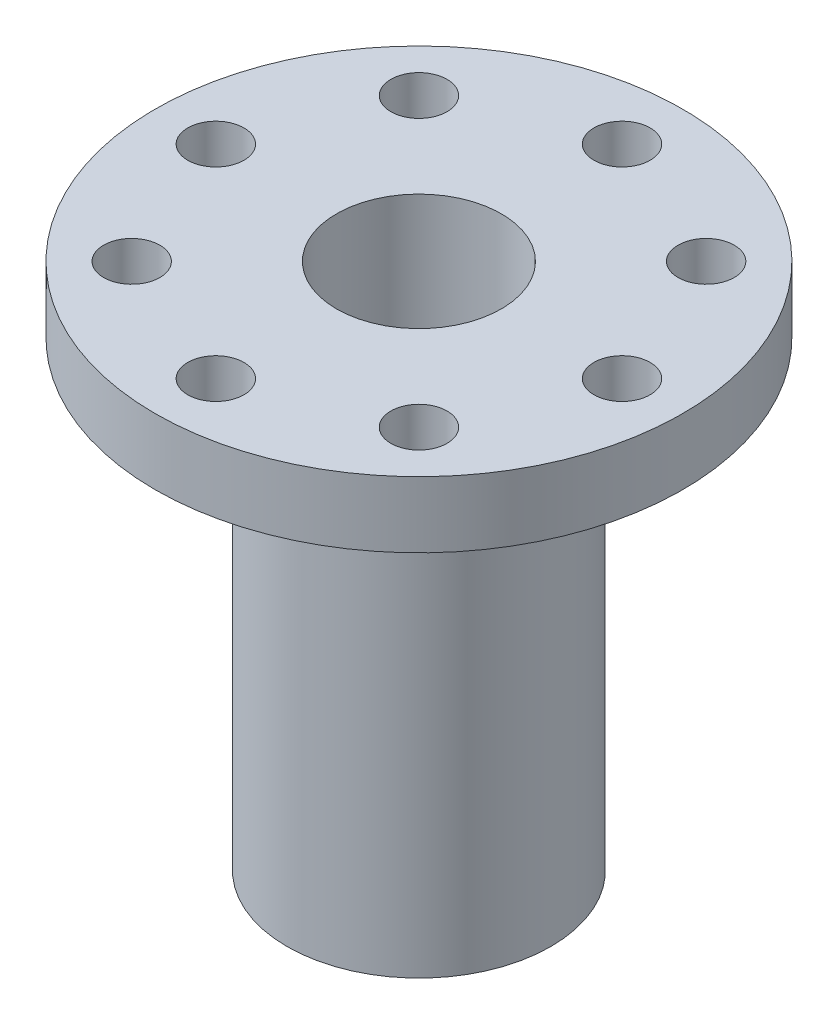
ISO-10303-21;
HEADER;
FILE_DESCRIPTION(('STEP AP214'),'2;1');
FILE_NAME('part.step','',(''),(''),'','','');
FILE_SCHEMA(('AUTOMOTIVE_DESIGN { 1 0 10303 214 1 1 1 1 }'));
ENDSEC;
DATA;
#1=APPLICATION_CONTEXT('core data for automotive mechanical design processes');
#2=APPLICATION_PROTOCOL_DEFINITION('international standard','automotive_design',2000,#1);
#3=PRODUCT_CONTEXT('',#1,'mechanical');
#4=PRODUCT('Part','Part','',(#3));
#5=PRODUCT_RELATED_PRODUCT_CATEGORY('part','',(#4));
#6=PRODUCT_DEFINITION_FORMATION('','',#4);
#7=PRODUCT_DEFINITION_CONTEXT('part definition',#1,'design');
#8=PRODUCT_DEFINITION('design','',#6,#7);
#9=PRODUCT_DEFINITION_SHAPE('','',#8);
#10=(LENGTH_UNIT() NAMED_UNIT(*) SI_UNIT(.MILLI.,.METRE.));
#11=(NAMED_UNIT(*) PLANE_ANGLE_UNIT() SI_UNIT($,.RADIAN.));
#12=(NAMED_UNIT(*) SI_UNIT($,.STERADIAN.) SOLID_ANGLE_UNIT());
#13=UNCERTAINTY_MEASURE_WITH_UNIT(LENGTH_MEASURE(1.E-05),#10,'distance_accuracy_value','');
#14=(GEOMETRIC_REPRESENTATION_CONTEXT(3) GLOBAL_UNCERTAINTY_ASSIGNED_CONTEXT((#13)) GLOBAL_UNIT_ASSIGNED_CONTEXT((#10,
#11,#12)) REPRESENTATION_CONTEXT('',''));
#15=CARTESIAN_POINT('',(0.,0.,0.));
#16=DIRECTION('',(0.,0.,1.));
#17=DIRECTION('',(1.,0.,0.));
#18=AXIS2_PLACEMENT_3D('',#15,#16,#17);
#19=CARTESIAN_POINT('',(0.,3.175,0.));
#20=DIRECTION('',(0.,-1.,0.));
#21=DIRECTION('',(0.,0.,-1.));
#22=AXIS2_PLACEMENT_3D('',#19,#20,#21);
#23=CYLINDRICAL_SURFACE('',#22,12.7);
#24=CARTESIAN_POINT('',(0.,3.175,0.));
#25=DIRECTION('',(0.,1.,0.));
#26=DIRECTION('',(0.,0.,1.));
#27=AXIS2_PLACEMENT_3D('',#24,#25,#26);
#28=CIRCLE('',#27,12.7);
#29=CARTESIAN_POINT('',(0.,3.175,12.7));
#30=VERTEX_POINT('',#29);
#31=EDGE_CURVE('E10',#30,#30,#28,.T.);
#32=ORIENTED_EDGE('',*,*,#31,.F.);
#33=EDGE_LOOP('',(#32));
#34=FACE_BOUND('',#33,.T.);
#35=CARTESIAN_POINT('',(0.,0.,0.));
#36=DIRECTION('',(0.,1.,0.));
#37=DIRECTION('',(0.,0.,1.));
#38=AXIS2_PLACEMENT_3D('',#35,#36,#37);
#39=CIRCLE('',#38,12.7);
#40=CARTESIAN_POINT('',(0.,0.,12.7));
#41=VERTEX_POINT('',#40);
#42=EDGE_CURVE('E33',#41,#41,#39,.T.);
#43=ORIENTED_EDGE('',*,*,#42,.T.);
#44=EDGE_LOOP('',(#43));
#45=FACE_BOUND('',#44,.T.);
#46=ADVANCED_FACE('F30',(#34,#45),#23,.T.);
#47=CARTESIAN_POINT('',(0.,3.175,0.));
#48=DIRECTION('',(0.,1.,0.));
#49=DIRECTION('',(0.,0.,1.));
#50=AXIS2_PLACEMENT_3D('',#47,#48,#49);
#51=PLANE('',#50);
#52=CARTESIAN_POINT('',(0.,3.175,-9.779));
#53=DIRECTION('',(0.,1.,0.));
#54=DIRECTION('',(0.,0.,1.));
#55=AXIS2_PLACEMENT_3D('',#52,#53,#54);
#56=CIRCLE('',#55,1.35255);
#57=CARTESIAN_POINT('',(0.,3.175,-8.42645));
#58=VERTEX_POINT('',#57);
#59=EDGE_CURVE('E110',#58,#58,#56,.T.);
#60=ORIENTED_EDGE('',*,*,#59,.F.);
#61=EDGE_LOOP('',(#60));
#62=FACE_BOUND('',#61,.T.);
#63=CARTESIAN_POINT('',(6.91479721322326,3.175,-6.91479721322324));
#64=DIRECTION('',(0.,1.,0.));
#65=DIRECTION('',(0.,0.,1.));
#66=AXIS2_PLACEMENT_3D('',#63,#64,#65);
#67=CIRCLE('',#66,1.35255);
#68=CARTESIAN_POINT('',(6.91479721322326,3.175,-5.56224721322324));
#69=VERTEX_POINT('',#68);
#70=EDGE_CURVE('E104',#69,#69,#67,.T.);
#71=ORIENTED_EDGE('',*,*,#70,.F.);
#72=EDGE_LOOP('',(#71));
#73=FACE_BOUND('',#72,.T.);
#74=CARTESIAN_POINT('',(9.779,3.175,0.));
#75=DIRECTION('',(0.,1.,0.));
#76=DIRECTION('',(0.,0.,1.));
#77=AXIS2_PLACEMENT_3D('',#74,#75,#76);
#78=CIRCLE('',#77,1.35255);
#79=CARTESIAN_POINT('',(9.779,3.175,1.35255000000003));
#80=VERTEX_POINT('',#79);
#81=EDGE_CURVE('E98',#80,#80,#78,.T.);
#82=ORIENTED_EDGE('',*,*,#81,.F.);
#83=EDGE_LOOP('',(#82));
#84=FACE_BOUND('',#83,.T.);
#85=CARTESIAN_POINT('',(6.91479721322321,3.175,6.91479721322328));
#86=DIRECTION('',(0.,1.,0.));
#87=DIRECTION('',(0.,0.,1.));
#88=AXIS2_PLACEMENT_3D('',#85,#86,#87);
#89=CIRCLE('',#88,1.35255);
#90=CARTESIAN_POINT('',(6.91479721322321,3.175,8.26734721322328));
#91=VERTEX_POINT('',#90);
#92=EDGE_CURVE('E92',#91,#91,#89,.T.);
#93=ORIENTED_EDGE('',*,*,#92,.F.);
#94=EDGE_LOOP('',(#93));
#95=FACE_BOUND('',#94,.T.);
#96=CARTESIAN_POINT('',(0.,3.175,9.779));
#97=DIRECTION('',(0.,1.,0.));
#98=DIRECTION('',(0.,0.,1.));
#99=AXIS2_PLACEMENT_3D('',#96,#97,#98);
#100=CIRCLE('',#99,1.35255);
#101=CARTESIAN_POINT('',(0.,3.175,11.13155));
#102=VERTEX_POINT('',#101);
#103=EDGE_CURVE('E86',#102,#102,#100,.T.);
#104=ORIENTED_EDGE('',*,*,#103,.F.);
#105=EDGE_LOOP('',(#104));
#106=FACE_BOUND('',#105,.T.);
#107=CARTESIAN_POINT('',(-6.91479721322331,3.175,6.91479721322319));
#108=DIRECTION('',(0.,1.,0.));
#109=DIRECTION('',(0.,0.,1.));
#110=AXIS2_PLACEMENT_3D('',#107,#108,#109);
#111=CIRCLE('',#110,1.35255);
#112=CARTESIAN_POINT('',(-6.91479721322331,3.175,8.26734721322319));
#113=VERTEX_POINT('',#112);
#114=EDGE_CURVE('E80',#113,#113,#111,.T.);
#115=ORIENTED_EDGE('',*,*,#114,.F.);
#116=EDGE_LOOP('',(#115));
#117=FACE_BOUND('',#116,.T.);
#118=CARTESIAN_POINT('',(-9.779,3.175,-1.02429588037641E-13));
#119=DIRECTION('',(0.,1.,0.));
#120=DIRECTION('',(0.,0.,1.));
#121=AXIS2_PLACEMENT_3D('',#118,#119,#120);
#122=CIRCLE('',#121,1.35255);
#123=CARTESIAN_POINT('',(-9.779,3.175,1.3525499999999));
#124=VERTEX_POINT('',#123);
#125=EDGE_CURVE('E74',#124,#124,#122,.T.);
#126=ORIENTED_EDGE('',*,*,#125,.F.);
#127=EDGE_LOOP('',(#126));
#128=FACE_BOUND('',#127,.T.);
#129=CARTESIAN_POINT('',(-6.91479721322316,3.175,-6.91479721322333));
#130=DIRECTION('',(0.,1.,0.));
#131=DIRECTION('',(0.,0.,1.));
#132=AXIS2_PLACEMENT_3D('',#129,#130,#131);
#133=CIRCLE('',#132,1.35255);
#134=CARTESIAN_POINT('',(-6.91479721322316,3.175,-5.56224721322333));
#135=VERTEX_POINT('',#134);
#136=EDGE_CURVE('E68',#135,#135,#133,.T.);
#137=ORIENTED_EDGE('',*,*,#136,.F.);
#138=EDGE_LOOP('',(#137));
#139=FACE_BOUND('',#138,.T.);
#140=CARTESIAN_POINT('',(0.,3.175,0.));
#141=DIRECTION('',(0.,1.,0.));
#142=DIRECTION('',(0.,0.,1.));
#143=AXIS2_PLACEMENT_3D('',#140,#141,#142);
#144=CIRCLE('',#143,3.96875);
#145=CARTESIAN_POINT('',(0.,3.175,3.96875));
#146=VERTEX_POINT('',#145);
#147=EDGE_CURVE('E54',#146,#146,#144,.T.);
#148=ORIENTED_EDGE('',*,*,#147,.F.);
#149=EDGE_LOOP('',(#148));
#150=FACE_BOUND('',#149,.T.);
#151=ORIENTED_EDGE('',*,*,#31,.T.);
#152=EDGE_LOOP('',(#151));
#153=FACE_BOUND('',#152,.T.);
#154=ADVANCED_FACE('F116',(#62,#73,#84,#95,#106,#117,#128,#139,#150,#153),#51,.T.);
#155=CARTESIAN_POINT('',(0.,0.,0.));
#156=DIRECTION('',(0.,1.,0.));
#157=DIRECTION('',(0.,0.,1.));
#158=AXIS2_PLACEMENT_3D('',#155,#156,#157);
#159=PLANE('',#158);
#160=CARTESIAN_POINT('',(0.,0.,-9.779));
#161=DIRECTION('',(0.,1.,0.));
#162=DIRECTION('',(0.,0.,1.));
#163=AXIS2_PLACEMENT_3D('',#160,#161,#162);
#164=CIRCLE('',#163,1.35255);
#165=CARTESIAN_POINT('',(0.,0.,-8.42645));
#166=VERTEX_POINT('',#165);
#167=EDGE_CURVE('E107',#166,#166,#164,.T.);
#168=ORIENTED_EDGE('',*,*,#167,.T.);
#169=EDGE_LOOP('',(#168));
#170=FACE_BOUND('',#169,.T.);
#171=CARTESIAN_POINT('',(6.91479721322326,0.,-6.91479721322324));
#172=DIRECTION('',(0.,1.,0.));
#173=DIRECTION('',(0.,0.,1.));
#174=AXIS2_PLACEMENT_3D('',#171,#172,#173);
#175=CIRCLE('',#174,1.35255);
#176=CARTESIAN_POINT('',(6.91479721322326,0.,-5.56224721322324));
#177=VERTEX_POINT('',#176);
#178=EDGE_CURVE('E101',#177,#177,#175,.T.);
#179=ORIENTED_EDGE('',*,*,#178,.T.);
#180=EDGE_LOOP('',(#179));
#181=FACE_BOUND('',#180,.T.);
#182=CARTESIAN_POINT('',(9.779,0.,0.));
#183=DIRECTION('',(0.,1.,0.));
#184=DIRECTION('',(0.,0.,1.));
#185=AXIS2_PLACEMENT_3D('',#182,#183,#184);
#186=CIRCLE('',#185,1.35255);
#187=CARTESIAN_POINT('',(9.779,0.,1.35255000000003));
#188=VERTEX_POINT('',#187);
#189=EDGE_CURVE('E95',#188,#188,#186,.T.);
#190=ORIENTED_EDGE('',*,*,#189,.T.);
#191=EDGE_LOOP('',(#190));
#192=FACE_BOUND('',#191,.T.);
#193=CARTESIAN_POINT('',(6.91479721322321,0.,6.91479721322328));
#194=DIRECTION('',(0.,1.,0.));
#195=DIRECTION('',(0.,0.,1.));
#196=AXIS2_PLACEMENT_3D('',#193,#194,#195);
#197=CIRCLE('',#196,1.35255);
#198=CARTESIAN_POINT('',(6.91479721322321,0.,8.26734721322328));
#199=VERTEX_POINT('',#198);
#200=EDGE_CURVE('E89',#199,#199,#197,.T.);
#201=ORIENTED_EDGE('',*,*,#200,.T.);
#202=EDGE_LOOP('',(#201));
#203=FACE_BOUND('',#202,.T.);
#204=CARTESIAN_POINT('',(0.,0.,9.779));
#205=DIRECTION('',(0.,1.,0.));
#206=DIRECTION('',(0.,0.,1.));
#207=AXIS2_PLACEMENT_3D('',#204,#205,#206);
#208=CIRCLE('',#207,1.35255);
#209=CARTESIAN_POINT('',(0.,0.,11.13155));
#210=VERTEX_POINT('',#209);
#211=EDGE_CURVE('E83',#210,#210,#208,.T.);
#212=ORIENTED_EDGE('',*,*,#211,.T.);
#213=EDGE_LOOP('',(#212));
#214=FACE_BOUND('',#213,.T.);
#215=CARTESIAN_POINT('',(-6.91479721322331,0.,6.91479721322319));
#216=DIRECTION('',(0.,1.,0.));
#217=DIRECTION('',(0.,0.,1.));
#218=AXIS2_PLACEMENT_3D('',#215,#216,#217);
#219=CIRCLE('',#218,1.35255);
#220=CARTESIAN_POINT('',(-6.91479721322331,0.,8.26734721322319));
#221=VERTEX_POINT('',#220);
#222=EDGE_CURVE('E77',#221,#221,#219,.T.);
#223=ORIENTED_EDGE('',*,*,#222,.T.);
#224=EDGE_LOOP('',(#223));
#225=FACE_BOUND('',#224,.T.);
#226=CARTESIAN_POINT('',(-9.779,0.,-1.02429588037641E-13));
#227=DIRECTION('',(0.,1.,0.));
#228=DIRECTION('',(0.,0.,1.));
#229=AXIS2_PLACEMENT_3D('',#226,#227,#228);
#230=CIRCLE('',#229,1.35255);
#231=CARTESIAN_POINT('',(-9.779,0.,1.3525499999999));
#232=VERTEX_POINT('',#231);
#233=EDGE_CURVE('E71',#232,#232,#230,.T.);
#234=ORIENTED_EDGE('',*,*,#233,.T.);
#235=EDGE_LOOP('',(#234));
#236=FACE_BOUND('',#235,.T.);
#237=CARTESIAN_POINT('',(-6.91479721322316,0.,-6.91479721322333));
#238=DIRECTION('',(0.,1.,0.));
#239=DIRECTION('',(0.,0.,1.));
#240=AXIS2_PLACEMENT_3D('',#237,#238,#239);
#241=CIRCLE('',#240,1.35255);
#242=CARTESIAN_POINT('',(-6.91479721322316,0.,-5.56224721322333));
#243=VERTEX_POINT('',#242);
#244=EDGE_CURVE('E63',#243,#243,#241,.T.);
#245=ORIENTED_EDGE('',*,*,#244,.T.);
#246=EDGE_LOOP('',(#245));
#247=FACE_BOUND('',#246,.T.);
#248=CARTESIAN_POINT('',(0.,0.,0.));
#249=DIRECTION('',(0.,1.,0.));
#250=DIRECTION('',(0.,0.,1.));
#251=AXIS2_PLACEMENT_3D('',#248,#249,#250);
#252=CIRCLE('',#251,6.35);
#253=CARTESIAN_POINT('',(0.,0.,6.35));
#254=VERTEX_POINT('',#253);
#255=EDGE_CURVE('E42',#254,#254,#252,.T.);
#256=ORIENTED_EDGE('',*,*,#255,.T.);
#257=EDGE_LOOP('',(#256));
#258=FACE_BOUND('',#257,.T.);
#259=ORIENTED_EDGE('',*,*,#42,.F.);
#260=EDGE_LOOP('',(#259));
#261=FACE_BOUND('',#260,.T.);
#262=ADVANCED_FACE('F119',(#170,#181,#192,#203,#214,#225,#236,#247,#258,#261),#159,.F.);
#263=CARTESIAN_POINT('',(0.,-22.225,0.));
#264=DIRECTION('',(0.,1.,0.));
#265=DIRECTION('',(0.,0.,1.));
#266=AXIS2_PLACEMENT_3D('',#263,#264,#265);
#267=CYLINDRICAL_SURFACE('',#266,6.35);
#268=CARTESIAN_POINT('',(0.,-22.225,0.));
#269=DIRECTION('',(0.,1.,0.));
#270=DIRECTION('',(0.,0.,1.));
#271=AXIS2_PLACEMENT_3D('',#268,#269,#270);
#272=CIRCLE('',#271,6.35);
#273=CARTESIAN_POINT('',(0.,-22.225,6.35));
#274=VERTEX_POINT('',#273);
#275=EDGE_CURVE('E40',#274,#274,#272,.T.);
#276=ORIENTED_EDGE('',*,*,#275,.T.);
#277=EDGE_LOOP('',(#276));
#278=FACE_BOUND('',#277,.T.);
#279=ORIENTED_EDGE('',*,*,#255,.F.);
#280=EDGE_LOOP('',(#279));
#281=FACE_BOUND('',#280,.T.);
#282=ADVANCED_FACE('F162',(#278,#281),#267,.T.);
#283=CARTESIAN_POINT('',(0.,-22.225,0.));
#284=DIRECTION('',(0.,1.,0.));
#285=DIRECTION('',(0.,0.,1.));
#286=AXIS2_PLACEMENT_3D('',#283,#284,#285);
#287=PLANE('',#286);
#288=CARTESIAN_POINT('',(0.,-22.225,0.));
#289=DIRECTION('',(0.,-1.,0.));
#290=DIRECTION('',(0.,0.,-1.));
#291=AXIS2_PLACEMENT_3D('',#288,#289,#290);
#292=CIRCLE('',#291,3.);
#293=CARTESIAN_POINT('',(0.,-22.225,-3.));
#294=VERTEX_POINT('',#293);
#295=EDGE_CURVE('E48',#294,#294,#292,.T.);
#296=ORIENTED_EDGE('',*,*,#295,.F.);
#297=EDGE_LOOP('',(#296));
#298=FACE_BOUND('',#297,.T.);
#299=ORIENTED_EDGE('',*,*,#275,.F.);
#300=EDGE_LOOP('',(#299));
#301=FACE_BOUND('',#300,.T.);
#302=ADVANCED_FACE('F167',(#298,#301),#287,.F.);
#303=CARTESIAN_POINT('',(0.,-19.05,0.));
#304=DIRECTION('',(0.,-1.,0.));
#305=DIRECTION('',(0.,0.,-1.));
#306=AXIS2_PLACEMENT_3D('',#303,#304,#305);
#307=CYLINDRICAL_SURFACE('',#306,3.);
#308=CARTESIAN_POINT('',(0.,-19.05,0.));
#309=DIRECTION('',(0.,-1.,0.));
#310=DIRECTION('',(0.,0.,-1.));
#311=AXIS2_PLACEMENT_3D('',#308,#309,#310);
#312=CIRCLE('',#311,3.);
#313=CARTESIAN_POINT('',(0.,-19.05,-3.));
#314=VERTEX_POINT('',#313);
#315=EDGE_CURVE('E45',#314,#314,#312,.T.);
#316=ORIENTED_EDGE('',*,*,#315,.F.);
#317=EDGE_LOOP('',(#316));
#318=FACE_BOUND('',#317,.T.);
#319=ORIENTED_EDGE('',*,*,#295,.T.);
#320=EDGE_LOOP('',(#319));
#321=FACE_BOUND('',#320,.T.);
#322=ADVANCED_FACE('F150',(#318,#321),#307,.F.);
#323=CARTESIAN_POINT('',(0.,-19.05,0.));
#324=DIRECTION('',(0.,-1.,0.));
#325=DIRECTION('',(0.,0.,-1.));
#326=AXIS2_PLACEMENT_3D('',#323,#324,#325);
#327=PLANE('',#326);
#328=CARTESIAN_POINT('',(0.,-19.05,0.));
#329=DIRECTION('',(0.,-1.,0.));
#330=DIRECTION('',(0.,0.,-1.));
#331=AXIS2_PLACEMENT_3D('',#328,#329,#330);
#332=CIRCLE('',#331,1.6);
#333=CARTESIAN_POINT('',(0.,-19.05,-1.6));
#334=VERTEX_POINT('',#333);
#335=EDGE_CURVE('E60',#334,#334,#332,.F.);
#336=ORIENTED_EDGE('',*,*,#335,.T.);
#337=EDGE_LOOP('',(#336));
#338=FACE_BOUND('',#337,.T.);
#339=ORIENTED_EDGE('',*,*,#315,.T.);
#340=EDGE_LOOP('',(#339));
#341=FACE_BOUND('',#340,.T.);
#342=ADVANCED_FACE('F140',(#338,#341),#327,.T.);
#343=CARTESIAN_POINT('',(0.,-15.875,0.));
#344=DIRECTION('',(0.,1.,0.));
#345=DIRECTION('',(0.,0.,1.));
#346=AXIS2_PLACEMENT_3D('',#343,#344,#345);
#347=CYLINDRICAL_SURFACE('',#346,3.96875);
#348=CARTESIAN_POINT('',(0.,-15.875,0.));
#349=DIRECTION('',(0.,1.,0.));
#350=DIRECTION('',(0.,0.,1.));
#351=AXIS2_PLACEMENT_3D('',#348,#349,#350);
#352=CIRCLE('',#351,3.96875);
#353=CARTESIAN_POINT('',(0.,-15.875,3.96875));
#354=VERTEX_POINT('',#353);
#355=EDGE_CURVE('E51',#354,#354,#352,.T.);
#356=ORIENTED_EDGE('',*,*,#355,.F.);
#357=EDGE_LOOP('',(#356));
#358=FACE_BOUND('',#357,.T.);
#359=ORIENTED_EDGE('',*,*,#147,.T.);
#360=EDGE_LOOP('',(#359));
#361=FACE_BOUND('',#360,.T.);
#362=ADVANCED_FACE('F137',(#358,#361),#347,.F.);
#363=CARTESIAN_POINT('',(0.,-15.875,0.));
#364=DIRECTION('',(0.,1.,0.));
#365=DIRECTION('',(0.,0.,1.));
#366=AXIS2_PLACEMENT_3D('',#363,#364,#365);
#367=PLANE('',#366);
#368=CARTESIAN_POINT('',(0.,-15.875,0.));
#369=DIRECTION('',(0.,1.,0.));
#370=DIRECTION('',(0.,0.,1.));
#371=AXIS2_PLACEMENT_3D('',#368,#369,#370);
#372=CIRCLE('',#371,1.6);
#373=CARTESIAN_POINT('',(0.,-15.875,1.6));
#374=VERTEX_POINT('',#373);
#375=EDGE_CURVE('E57',#374,#374,#372,.T.);
#376=ORIENTED_EDGE('',*,*,#375,.F.);
#377=EDGE_LOOP('',(#376));
#378=FACE_BOUND('',#377,.T.);
#379=ORIENTED_EDGE('',*,*,#355,.T.);
#380=EDGE_LOOP('',(#379));
#381=FACE_BOUND('',#380,.T.);
#382=ADVANCED_FACE('F139',(#378,#381),#367,.T.);
#383=CARTESIAN_POINT('',(0.,-22.226,0.));
#384=DIRECTION('',(0.,1.,0.));
#385=DIRECTION('',(0.,0.,1.));
#386=AXIS2_PLACEMENT_3D('',#383,#384,#385);
#387=CYLINDRICAL_SURFACE('',#386,1.6);
#388=ORIENTED_EDGE('',*,*,#335,.F.);
#389=EDGE_LOOP('',(#388));
#390=FACE_BOUND('',#389,.T.);
#391=ORIENTED_EDGE('',*,*,#375,.T.);
#392=EDGE_LOOP('',(#391));
#393=FACE_BOUND('',#392,.T.);
#394=ADVANCED_FACE('F147',(#390,#393),#387,.F.);
#395=CARTESIAN_POINT('',(-6.91479721322316,3.175,-6.91479721322333));
#396=DIRECTION('',(0.,1.,0.));
#397=DIRECTION('',(0.,0.,1.));
#398=AXIS2_PLACEMENT_3D('',#395,#396,#397);
#399=CYLINDRICAL_SURFACE('',#398,1.35255);
#400=ORIENTED_EDGE('',*,*,#244,.F.);
#401=EDGE_LOOP('',(#400));
#402=FACE_BOUND('',#401,.T.);
#403=ORIENTED_EDGE('',*,*,#136,.T.);
#404=EDGE_LOOP('',(#403));
#405=FACE_BOUND('',#404,.T.);
#406=ADVANCED_FACE('F211',(#402,#405),#399,.F.);
#407=CARTESIAN_POINT('',(-9.779,3.175,-1.02429588037641E-13));
#408=DIRECTION('',(0.,1.,0.));
#409=DIRECTION('',(0.,0.,1.));
#410=AXIS2_PLACEMENT_3D('',#407,#408,#409);
#411=CYLINDRICAL_SURFACE('',#410,1.35255);
#412=ORIENTED_EDGE('',*,*,#233,.F.);
#413=EDGE_LOOP('',(#412));
#414=FACE_BOUND('',#413,.T.);
#415=ORIENTED_EDGE('',*,*,#125,.T.);
#416=EDGE_LOOP('',(#415));
#417=FACE_BOUND('',#416,.T.);
#418=ADVANCED_FACE('F233',(#414,#417),#411,.F.);
#419=CARTESIAN_POINT('',(-6.91479721322331,3.175,6.91479721322319));
#420=DIRECTION('',(0.,1.,0.));
#421=DIRECTION('',(0.,0.,1.));
#422=AXIS2_PLACEMENT_3D('',#419,#420,#421);
#423=CYLINDRICAL_SURFACE('',#422,1.35255);
#424=ORIENTED_EDGE('',*,*,#222,.F.);
#425=EDGE_LOOP('',(#424));
#426=FACE_BOUND('',#425,.T.);
#427=ORIENTED_EDGE('',*,*,#114,.T.);
#428=EDGE_LOOP('',(#427));
#429=FACE_BOUND('',#428,.T.);
#430=ADVANCED_FACE('F243',(#426,#429),#423,.F.);
#431=CARTESIAN_POINT('',(0.,3.175,9.779));
#432=DIRECTION('',(0.,1.,0.));
#433=DIRECTION('',(0.,0.,1.));
#434=AXIS2_PLACEMENT_3D('',#431,#432,#433);
#435=CYLINDRICAL_SURFACE('',#434,1.35255);
#436=ORIENTED_EDGE('',*,*,#211,.F.);
#437=EDGE_LOOP('',(#436));
#438=FACE_BOUND('',#437,.T.);
#439=ORIENTED_EDGE('',*,*,#103,.T.);
#440=EDGE_LOOP('',(#439));
#441=FACE_BOUND('',#440,.T.);
#442=ADVANCED_FACE('F253',(#438,#441),#435,.F.);
#443=CARTESIAN_POINT('',(6.91479721322321,3.175,6.91479721322328));
#444=DIRECTION('',(0.,1.,0.));
#445=DIRECTION('',(0.,0.,1.));
#446=AXIS2_PLACEMENT_3D('',#443,#444,#445);
#447=CYLINDRICAL_SURFACE('',#446,1.35255);
#448=ORIENTED_EDGE('',*,*,#200,.F.);
#449=EDGE_LOOP('',(#448));
#450=FACE_BOUND('',#449,.T.);
#451=ORIENTED_EDGE('',*,*,#92,.T.);
#452=EDGE_LOOP('',(#451));
#453=FACE_BOUND('',#452,.T.);
#454=ADVANCED_FACE('F263',(#450,#453),#447,.F.);
#455=CARTESIAN_POINT('',(9.779,3.175,0.));
#456=DIRECTION('',(0.,1.,0.));
#457=DIRECTION('',(0.,0.,1.));
#458=AXIS2_PLACEMENT_3D('',#455,#456,#457);
#459=CYLINDRICAL_SURFACE('',#458,1.35255);
#460=ORIENTED_EDGE('',*,*,#189,.F.);
#461=EDGE_LOOP('',(#460));
#462=FACE_BOUND('',#461,.T.);
#463=ORIENTED_EDGE('',*,*,#81,.T.);
#464=EDGE_LOOP('',(#463));
#465=FACE_BOUND('',#464,.T.);
#466=ADVANCED_FACE('F273',(#462,#465),#459,.F.);
#467=CARTESIAN_POINT('',(6.91479721322326,3.175,-6.91479721322324));
#468=DIRECTION('',(0.,1.,0.));
#469=DIRECTION('',(0.,0.,1.));
#470=AXIS2_PLACEMENT_3D('',#467,#468,#469);
#471=CYLINDRICAL_SURFACE('',#470,1.35255);
#472=ORIENTED_EDGE('',*,*,#178,.F.);
#473=EDGE_LOOP('',(#472));
#474=FACE_BOUND('',#473,.T.);
#475=ORIENTED_EDGE('',*,*,#70,.T.);
#476=EDGE_LOOP('',(#475));
#477=FACE_BOUND('',#476,.T.);
#478=ADVANCED_FACE('F283',(#474,#477),#471,.F.);
#479=CARTESIAN_POINT('',(0.,3.175,-9.779));
#480=DIRECTION('',(0.,1.,0.));
#481=DIRECTION('',(0.,0.,1.));
#482=AXIS2_PLACEMENT_3D('',#479,#480,#481);
#483=CYLINDRICAL_SURFACE('',#482,1.35255);
#484=ORIENTED_EDGE('',*,*,#167,.F.);
#485=EDGE_LOOP('',(#484));
#486=FACE_BOUND('',#485,.T.);
#487=ORIENTED_EDGE('',*,*,#59,.T.);
#488=EDGE_LOOP('',(#487));
#489=FACE_BOUND('',#488,.T.);
#490=ADVANCED_FACE('F114',(#486,#489),#483,.F.);
#491=CLOSED_SHELL('',(#46,#154,#262,#282,#302,#322,#342,#362,#382,#394,#406,#418,#430,#442,#454,
#466,#478,#490));
#492=MANIFOLD_SOLID_BREP('B2',#491);
#493=ADVANCED_BREP_SHAPE_REPRESENTATION('',(#18,#492),#14);
#494=SHAPE_DEFINITION_REPRESENTATION(#9,#493);
ENDSEC;
END-ISO-10303-21;
